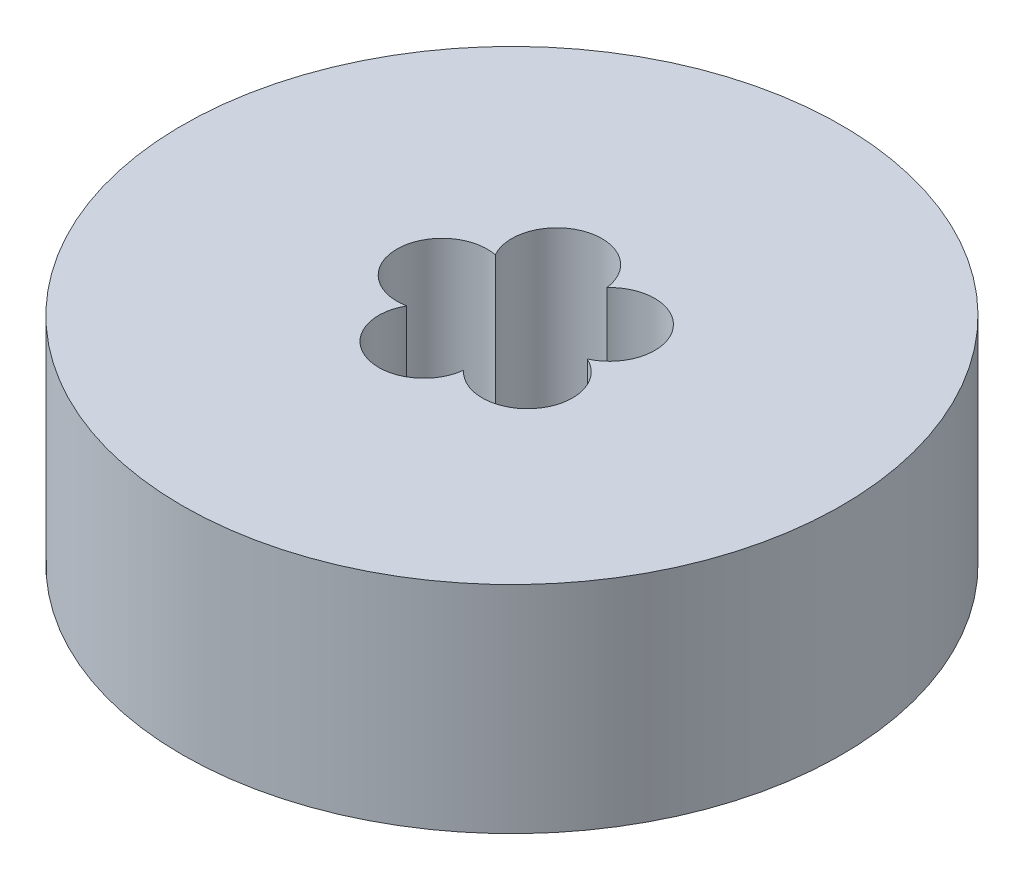
ISO-10303-21;
HEADER;
FILE_DESCRIPTION(('STEP AP214'),'2;1');
FILE_NAME('part.step','',(''),(''),'','','');
FILE_SCHEMA(('AUTOMOTIVE_DESIGN { 1 0 10303 214 1 1 1 1 }'));
ENDSEC;
DATA;
#1=APPLICATION_CONTEXT('core data for automotive mechanical design processes');
#2=APPLICATION_PROTOCOL_DEFINITION('international standard','automotive_design',2000,#1);
#3=PRODUCT_CONTEXT('',#1,'mechanical');
#4=PRODUCT('Part','Part','',(#3));
#5=PRODUCT_RELATED_PRODUCT_CATEGORY('part','',(#4));
#6=PRODUCT_DEFINITION_FORMATION('','',#4);
#7=PRODUCT_DEFINITION_CONTEXT('part definition',#1,'design');
#8=PRODUCT_DEFINITION('design','',#6,#7);
#9=PRODUCT_DEFINITION_SHAPE('','',#8);
#10=(LENGTH_UNIT() NAMED_UNIT(*) SI_UNIT(.MILLI.,.METRE.));
#11=(NAMED_UNIT(*) PLANE_ANGLE_UNIT() SI_UNIT($,.RADIAN.));
#12=(NAMED_UNIT(*) SI_UNIT($,.STERADIAN.) SOLID_ANGLE_UNIT());
#13=UNCERTAINTY_MEASURE_WITH_UNIT(LENGTH_MEASURE(1.E-05),#10,'distance_accuracy_value','');
#14=(GEOMETRIC_REPRESENTATION_CONTEXT(3) GLOBAL_UNCERTAINTY_ASSIGNED_CONTEXT((#13)) GLOBAL_UNIT_ASSIGNED_CONTEXT((#10,
#11,#12)) REPRESENTATION_CONTEXT('',''));
#15=CARTESIAN_POINT('',(0.,0.,0.));
#16=DIRECTION('',(0.,0.,1.));
#17=DIRECTION('',(1.,0.,0.));
#18=AXIS2_PLACEMENT_3D('',#15,#16,#17);
#19=CARTESIAN_POINT('',(0.,18.,0.));
#20=DIRECTION('',(0.,-1.,0.));
#21=DIRECTION('',(0.,0.,-1.));
#22=AXIS2_PLACEMENT_3D('',#19,#20,#21);
#23=CYLINDRICAL_SURFACE('',#22,5.);
#24=CARTESIAN_POINT('',(0.,0.,0.));
#25=DIRECTION('',(0.,1.,0.));
#26=DIRECTION('',(0.,0.,1.));
#27=AXIS2_PLACEMENT_3D('',#24,#25,#26);
#28=CIRCLE('',#27,5.);
#29=CARTESIAN_POINT('',(0.,0.,5.));
#30=VERTEX_POINT('',#29);
#31=EDGE_CURVE('E129',#30,#30,#28,.T.);
#32=ORIENTED_EDGE('',*,*,#31,.F.);
#33=EDGE_LOOP('',(#32));
#34=FACE_BOUND('',#33,.T.);
#35=CARTESIAN_POINT('',(0.,2.74118527102743,0.));
#36=DIRECTION('',(0.,1.,0.));
#37=DIRECTION('',(0.,0.,1.));
#38=AXIS2_PLACEMENT_3D('',#35,#36,#37);
#39=CIRCLE('',#38,5.);
#40=CARTESIAN_POINT('',(0.,2.74118527102743,5.));
#41=VERTEX_POINT('',#40);
#42=EDGE_CURVE('E11',#41,#41,#39,.T.);
#43=ORIENTED_EDGE('',*,*,#42,.T.);
#44=EDGE_LOOP('',(#43));
#45=FACE_BOUND('',#44,.T.);
#46=ADVANCED_FACE('F39',(#34,#45),#23,.F.);
#47=CARTESIAN_POINT('',(0.,18.,0.));
#48=DIRECTION('',(0.,-1.,0.));
#49=DIRECTION('',(0.,0.,-1.));
#50=AXIS2_PLACEMENT_3D('',#47,#48,#49);
#51=CYLINDRICAL_SURFACE('',#50,27.5);
#52=CARTESIAN_POINT('',(0.,18.,0.));
#53=DIRECTION('',(0.,1.,0.));
#54=DIRECTION('',(0.,0.,1.));
#55=AXIS2_PLACEMENT_3D('',#52,#53,#54);
#56=CIRCLE('',#55,27.5);
#57=CARTESIAN_POINT('',(0.,18.,27.5));
#58=VERTEX_POINT('',#57);
#59=EDGE_CURVE('E50',#58,#58,#56,.T.);
#60=ORIENTED_EDGE('',*,*,#59,.F.);
#61=EDGE_LOOP('',(#60));
#62=FACE_BOUND('',#61,.T.);
#63=CARTESIAN_POINT('',(0.,0.,0.));
#64=DIRECTION('',(0.,1.,0.));
#65=DIRECTION('',(0.,0.,1.));
#66=AXIS2_PLACEMENT_3D('',#63,#64,#65);
#67=CIRCLE('',#66,27.5);
#68=CARTESIAN_POINT('',(0.,0.,27.5));
#69=VERTEX_POINT('',#68);
#70=EDGE_CURVE('E133',#69,#69,#67,.T.);
#71=ORIENTED_EDGE('',*,*,#70,.T.);
#72=EDGE_LOOP('',(#71));
#73=FACE_BOUND('',#72,.T.);
#74=ADVANCED_FACE('F41',(#62,#73),#51,.T.);
#75=CARTESIAN_POINT('',(0.,18.,0.));
#76=DIRECTION('',(0.,1.,0.));
#77=DIRECTION('',(0.,0.,1.));
#78=AXIS2_PLACEMENT_3D('',#75,#76,#77);
#79=PLANE('',#78);
#80=CARTESIAN_POINT('',(-1.80241173143097,18.,5.54725291303669));
#81=DIRECTION('',(0.,1.,0.));
#82=DIRECTION('',(0.951056516295155,0.,0.309016994374945));
#83=AXIS2_PLACEMENT_3D('',#80,#81,#82);
#84=CIRCLE('',#83,3.76957529529589);
#85=CARTESIAN_POINT('',(-5.08538802710011,18.,3.69475067309752));
#86=VERTEX_POINT('',#85);
#87=CARTESIAN_POINT('',(1.9424453803705,18.,5.97823216902832));
#88=VERTEX_POINT('',#87);
#89=EDGE_CURVE('E119',#86,#88,#84,.T.);
#90=ORIENTED_EDGE('',*,*,#89,.F.);
#91=CARTESIAN_POINT('',(-5.83272688635375,18.,0.));
#92=DIRECTION('',(0.,1.,0.));
#93=DIRECTION('',(0.,0.,1.));
#94=AXIS2_PLACEMENT_3D('',#91,#92,#93);
#95=CIRCLE('',#94,3.76957529529589);
#96=CARTESIAN_POINT('',(-5.08538802710022,18.,-3.69475067309754));
#97=VERTEX_POINT('',#96);
#98=EDGE_CURVE('E127',#97,#86,#95,.T.);
#99=ORIENTED_EDGE('',*,*,#98,.F.);
#100=CARTESIAN_POINT('',(-1.80241173143105,18.,-5.54725291303666));
#101=DIRECTION('',(0.,1.,0.));
#102=DIRECTION('',(-0.95105651629515,0.,0.309016994374958));
#103=AXIS2_PLACEMENT_3D('',#100,#101,#102);
#104=CIRCLE('',#103,3.76957529529589);
#105=CARTESIAN_POINT('',(1.94244538037042,18.,-5.97823216902835));
#106=VERTEX_POINT('',#105);
#107=EDGE_CURVE('E53',#106,#97,#104,.T.);
#108=ORIENTED_EDGE('',*,*,#107,.F.);
#109=CARTESIAN_POINT('',(4.71877517460783,18.,-3.42839084444857));
#110=DIRECTION('',(0.,1.,0.));
#111=DIRECTION('',(-0.58778525229248,0.,-0.809016994374942));
#112=AXIS2_PLACEMENT_3D('',#109,#110,#111);
#113=CIRCLE('',#112,3.76957529529589);
#114=CARTESIAN_POINT('',(6.28588529345929,18.,0.));
#115=VERTEX_POINT('',#114);
#116=EDGE_CURVE('E99',#115,#106,#113,.T.);
#117=ORIENTED_EDGE('',*,*,#116,.F.);
#118=CARTESIAN_POINT('',(4.71877517460788,18.,3.42839084444851));
#119=DIRECTION('',(0.,1.,0.));
#120=DIRECTION('',(0.587785252292469,0.,-0.809016994374951));
#121=AXIS2_PLACEMENT_3D('',#118,#119,#120);
#122=CIRCLE('',#121,3.76957529529589);
#123=EDGE_CURVE('E113',#88,#115,#122,.T.);
#124=ORIENTED_EDGE('',*,*,#123,.F.);
#125=EDGE_LOOP('',(#90,#99,#108,#117,#124));
#126=FACE_BOUND('',#125,.T.);
#127=ORIENTED_EDGE('',*,*,#59,.T.);
#128=EDGE_LOOP('',(#127));
#129=FACE_BOUND('',#128,.T.);
#130=ADVANCED_FACE('F141',(#126,#129),#79,.T.);
#131=CARTESIAN_POINT('',(0.,0.,0.));
#132=DIRECTION('',(0.,1.,0.));
#133=DIRECTION('',(0.,0.,1.));
#134=AXIS2_PLACEMENT_3D('',#131,#132,#133);
#135=PLANE('',#134);
#136=ORIENTED_EDGE('',*,*,#31,.T.);
#137=EDGE_LOOP('',(#136));
#138=FACE_BOUND('',#137,.T.);
#139=ORIENTED_EDGE('',*,*,#70,.F.);
#140=EDGE_LOOP('',(#139));
#141=FACE_BOUND('',#140,.T.);
#142=ADVANCED_FACE('F139',(#138,#141),#135,.F.);
#143=CARTESIAN_POINT('',(-5.83272688635375,2.74118527102743,0.));
#144=DIRECTION('',(0.,1.,0.));
#145=DIRECTION('',(0.,0.,1.));
#146=AXIS2_PLACEMENT_3D('',#143,#144,#145);
#147=CYLINDRICAL_SURFACE('',#146,3.76957529529589);
#148=ORIENTED_EDGE('',*,*,#98,.T.);
#149=DIRECTION('',(0.,1.,0.));
#150=VECTOR('',#149,1.);
#151=CARTESIAN_POINT('',(-5.08538802710011,10.3705926355137,3.69475067309752));
#152=LINE('',#151,#150);
#153=CARTESIAN_POINT('',(-5.08538802710011,2.74118527102743,3.69475067309752));
#154=VERTEX_POINT('',#153);
#155=EDGE_CURVE('E65',#86,#154,#152,.F.);
#156=ORIENTED_EDGE('',*,*,#155,.T.);
#157=CARTESIAN_POINT('',(-5.83272688635375,2.74118527102743,0.));
#158=DIRECTION('',(0.,1.,0.));
#159=DIRECTION('',(0.,0.,1.));
#160=AXIS2_PLACEMENT_3D('',#157,#158,#159);
#161=CIRCLE('',#160,3.76957529529589);
#162=CARTESIAN_POINT('',(-5.08538802710022,2.74118527102743,-3.69475067309754));
#163=VERTEX_POINT('',#162);
#164=EDGE_CURVE('E130',#163,#154,#161,.T.);
#165=ORIENTED_EDGE('',*,*,#164,.F.);
#166=DIRECTION('',(0.,1.,0.));
#167=VECTOR('',#166,1.);
#168=CARTESIAN_POINT('',(-5.08538802710022,10.3705926355137,-3.69475067309754));
#169=LINE('',#168,#167);
#170=EDGE_CURVE('E108',#163,#97,#169,.T.);
#171=ORIENTED_EDGE('',*,*,#170,.T.);
#172=EDGE_LOOP('',(#148,#156,#165,#171));
#173=FACE_BOUND('',#172,.T.);
#174=ADVANCED_FACE('F142',(#173),#147,.F.);
#175=CARTESIAN_POINT('',(-5.83272688635375,2.74118527102743,0.));
#176=DIRECTION('',(0.,1.,0.));
#177=DIRECTION('',(0.,0.,1.));
#178=AXIS2_PLACEMENT_3D('',#175,#176,#177);
#179=PLANE('',#178);
#180=ORIENTED_EDGE('',*,*,#164,.T.);
#181=CARTESIAN_POINT('',(-1.80241173143097,2.74118527102743,5.54725291303669));
#182=DIRECTION('',(0.,1.,0.));
#183=DIRECTION('',(0.951056516295155,0.,0.309016994374945));
#184=AXIS2_PLACEMENT_3D('',#181,#182,#183);
#185=CIRCLE('',#184,3.76957529529589);
#186=CARTESIAN_POINT('',(1.9424453803705,2.74118527102743,5.97823216902832));
#187=VERTEX_POINT('',#186);
#188=EDGE_CURVE('E121',#154,#187,#185,.T.);
#189=ORIENTED_EDGE('',*,*,#188,.T.);
#190=CARTESIAN_POINT('',(4.71877517460788,2.74118527102743,3.42839084444851));
#191=DIRECTION('',(0.,1.,0.));
#192=DIRECTION('',(0.587785252292469,0.,-0.809016994374951));
#193=AXIS2_PLACEMENT_3D('',#190,#191,#192);
#194=CIRCLE('',#193,3.76957529529589);
#195=CARTESIAN_POINT('',(6.28588529345929,2.74118527102743,0.));
#196=VERTEX_POINT('',#195);
#197=EDGE_CURVE('E92',#187,#196,#194,.T.);
#198=ORIENTED_EDGE('',*,*,#197,.T.);
#199=CARTESIAN_POINT('',(4.71877517460783,2.74118527102743,-3.42839084444857));
#200=DIRECTION('',(0.,1.,0.));
#201=DIRECTION('',(-0.58778525229248,0.,-0.809016994374942));
#202=AXIS2_PLACEMENT_3D('',#199,#200,#201);
#203=CIRCLE('',#202,3.76957529529589);
#204=CARTESIAN_POINT('',(1.94244538037041,2.74118527102743,-5.97823216902835));
#205=VERTEX_POINT('',#204);
#206=EDGE_CURVE('E88',#196,#205,#203,.T.);
#207=ORIENTED_EDGE('',*,*,#206,.T.);
#208=CARTESIAN_POINT('',(-1.80241173143105,2.74118527102743,-5.54725291303666));
#209=DIRECTION('',(0.,1.,0.));
#210=DIRECTION('',(-0.95105651629515,0.,0.309016994374958));
#211=AXIS2_PLACEMENT_3D('',#208,#209,#210);
#212=CIRCLE('',#211,3.76957529529589);
#213=EDGE_CURVE('E95',#205,#163,#212,.T.);
#214=ORIENTED_EDGE('',*,*,#213,.T.);
#215=EDGE_LOOP('',(#180,#189,#198,#207,#214));
#216=FACE_BOUND('',#215,.T.);
#217=ORIENTED_EDGE('',*,*,#42,.F.);
#218=EDGE_LOOP('',(#217));
#219=FACE_BOUND('',#218,.T.);
#220=ADVANCED_FACE('F90',(#216,#219),#179,.T.);
#221=CARTESIAN_POINT('',(-1.80241173143097,2.74118527102743,5.54725291303669));
#222=DIRECTION('',(0.,1.,0.));
#223=DIRECTION('',(0.,0.,1.));
#224=AXIS2_PLACEMENT_3D('',#221,#222,#223);
#225=CYLINDRICAL_SURFACE('',#224,3.76957529529589);
#226=ORIENTED_EDGE('',*,*,#89,.T.);
#227=DIRECTION('',(0.,1.,0.));
#228=VECTOR('',#227,1.);
#229=CARTESIAN_POINT('',(1.9424453803705,10.3705926355137,5.97823216902832));
#230=LINE('',#229,#228);
#231=EDGE_CURVE('E106',#88,#187,#230,.F.);
#232=ORIENTED_EDGE('',*,*,#231,.T.);
#233=ORIENTED_EDGE('',*,*,#188,.F.);
#234=ORIENTED_EDGE('',*,*,#155,.F.);
#235=EDGE_LOOP('',(#226,#232,#233,#234));
#236=FACE_BOUND('',#235,.T.);
#237=ADVANCED_FACE('F164',(#236),#225,.F.);
#238=CARTESIAN_POINT('',(-1.80241173143105,2.74118527102743,-5.54725291303666));
#239=DIRECTION('',(0.,1.,0.));
#240=DIRECTION('',(0.,0.,1.));
#241=AXIS2_PLACEMENT_3D('',#238,#239,#240);
#242=CYLINDRICAL_SURFACE('',#241,3.76957529529589);
#243=ORIENTED_EDGE('',*,*,#213,.F.);
#244=DIRECTION('',(0.,1.,0.));
#245=VECTOR('',#244,1.);
#246=CARTESIAN_POINT('',(1.94244538037041,10.3705926355137,-5.97823216902835));
#247=LINE('',#246,#245);
#248=EDGE_CURVE('E103',#106,#205,#247,.F.);
#249=ORIENTED_EDGE('',*,*,#248,.F.);
#250=ORIENTED_EDGE('',*,*,#107,.T.);
#251=ORIENTED_EDGE('',*,*,#170,.F.);
#252=EDGE_LOOP('',(#243,#249,#250,#251));
#253=FACE_BOUND('',#252,.T.);
#254=ADVANCED_FACE('F107',(#253),#242,.F.);
#255=CARTESIAN_POINT('',(4.71877517460788,2.74118527102743,3.42839084444851));
#256=DIRECTION('',(0.,1.,0.));
#257=DIRECTION('',(0.,0.,1.));
#258=AXIS2_PLACEMENT_3D('',#255,#256,#257);
#259=CYLINDRICAL_SURFACE('',#258,3.76957529529589);
#260=ORIENTED_EDGE('',*,*,#123,.T.);
#261=DIRECTION('',(0.,1.,0.));
#262=VECTOR('',#261,1.);
#263=CARTESIAN_POINT('',(6.28588529345929,10.3705926355137,0.));
#264=LINE('',#263,#262);
#265=EDGE_CURVE('E97',#115,#196,#264,.F.);
#266=ORIENTED_EDGE('',*,*,#265,.T.);
#267=ORIENTED_EDGE('',*,*,#197,.F.);
#268=ORIENTED_EDGE('',*,*,#231,.F.);
#269=EDGE_LOOP('',(#260,#266,#267,#268));
#270=FACE_BOUND('',#269,.T.);
#271=ADVANCED_FACE('F169',(#270),#259,.F.);
#272=CARTESIAN_POINT('',(4.71877517460783,2.74118527102743,-3.42839084444857));
#273=DIRECTION('',(0.,1.,0.));
#274=DIRECTION('',(0.,0.,1.));
#275=AXIS2_PLACEMENT_3D('',#272,#273,#274);
#276=CYLINDRICAL_SURFACE('',#275,3.76957529529589);
#277=ORIENTED_EDGE('',*,*,#248,.T.);
#278=ORIENTED_EDGE('',*,*,#206,.F.);
#279=ORIENTED_EDGE('',*,*,#265,.F.);
#280=ORIENTED_EDGE('',*,*,#116,.T.);
#281=EDGE_LOOP('',(#277,#278,#279,#280));
#282=FACE_BOUND('',#281,.T.);
#283=ADVANCED_FACE('F102',(#282),#276,.F.);
#284=CLOSED_SHELL('',(#46,#74,#130,#142,#174,#220,#237,#254,#271,#283));
#285=MANIFOLD_SOLID_BREP('B2',#284);
#286=ADVANCED_BREP_SHAPE_REPRESENTATION('',(#18,#285),#14);
#287=SHAPE_DEFINITION_REPRESENTATION(#9,#286);
ENDSEC;
END-ISO-10303-21;
